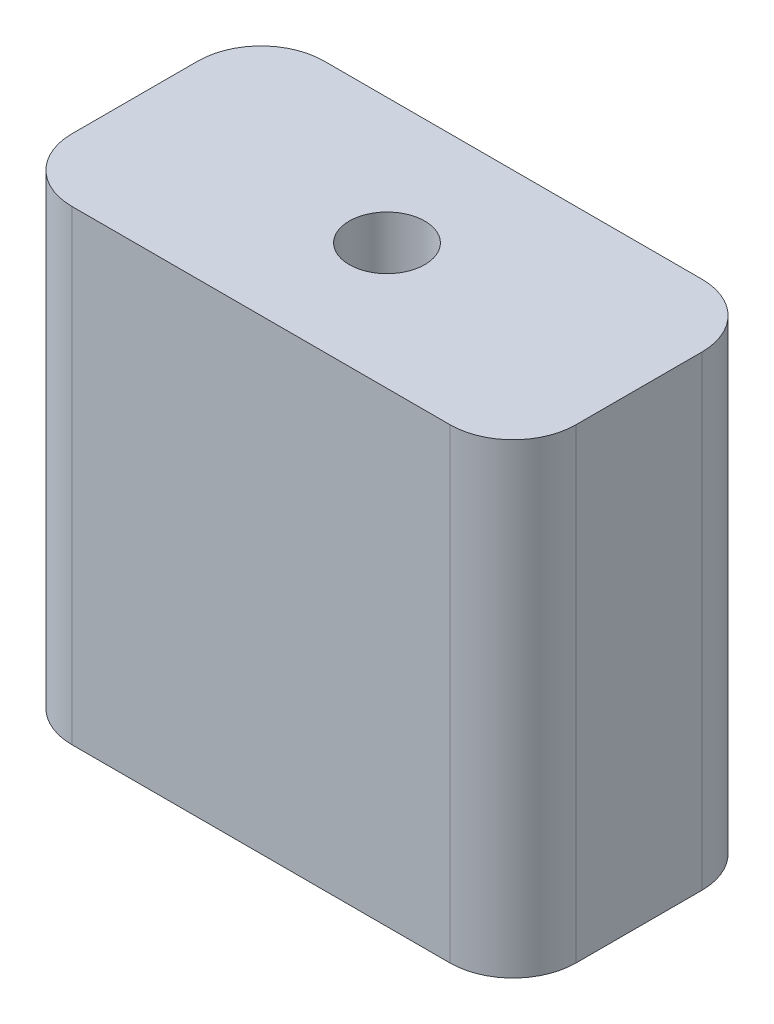
ISO-10303-21;
HEADER;
FILE_DESCRIPTION(('STEP AP214'),'2;1');
FILE_NAME('part.step','',(''),(''),'','','');
FILE_SCHEMA(('AUTOMOTIVE_DESIGN { 1 0 10303 214 1 1 1 1 }'));
ENDSEC;
DATA;
#1=APPLICATION_CONTEXT('core data for automotive mechanical design processes');
#2=APPLICATION_PROTOCOL_DEFINITION('international standard','automotive_design',2000,#1);
#3=PRODUCT_CONTEXT('',#1,'mechanical');
#4=PRODUCT('Part','Part','',(#3));
#5=PRODUCT_RELATED_PRODUCT_CATEGORY('part','',(#4));
#6=PRODUCT_DEFINITION_FORMATION('','',#4);
#7=PRODUCT_DEFINITION_CONTEXT('part definition',#1,'design');
#8=PRODUCT_DEFINITION('design','',#6,#7);
#9=PRODUCT_DEFINITION_SHAPE('','',#8);
#10=(LENGTH_UNIT() NAMED_UNIT(*) SI_UNIT(.MILLI.,.METRE.));
#11=(NAMED_UNIT(*) PLANE_ANGLE_UNIT() SI_UNIT($,.RADIAN.));
#12=(NAMED_UNIT(*) SI_UNIT($,.STERADIAN.) SOLID_ANGLE_UNIT());
#13=UNCERTAINTY_MEASURE_WITH_UNIT(LENGTH_MEASURE(1.E-05),#10,'distance_accuracy_value','');
#14=(GEOMETRIC_REPRESENTATION_CONTEXT(3) GLOBAL_UNCERTAINTY_ASSIGNED_CONTEXT((#13)) GLOBAL_UNIT_ASSIGNED_CONTEXT((#10,
#11,#12)) REPRESENTATION_CONTEXT('',''));
#15=CARTESIAN_POINT('',(0.,0.,0.));
#16=DIRECTION('',(0.,0.,1.));
#17=DIRECTION('',(1.,0.,0.));
#18=AXIS2_PLACEMENT_3D('',#15,#16,#17);
#19=CARTESIAN_POINT('',(20.,37.,10.));
#20=DIRECTION('',(-1.,0.,0.));
#21=DIRECTION('',(0.,0.,1.));
#22=AXIS2_PLACEMENT_3D('',#19,#20,#21);
#23=PLANE('',#22);
#24=DIRECTION('',(0.,0.,-1.));
#25=VECTOR('',#24,1.);
#26=CARTESIAN_POINT('',(20.,0.,10.));
#27=LINE('',#26,#25);
#28=CARTESIAN_POINT('',(20.,0.,5.));
#29=VERTEX_POINT('',#28);
#30=CARTESIAN_POINT('',(20.,0.,-5.));
#31=VERTEX_POINT('',#30);
#32=EDGE_CURVE('E141',#29,#31,#27,.T.);
#33=ORIENTED_EDGE('',*,*,#32,.T.);
#34=DIRECTION('',(0.,-1.,0.));
#35=VECTOR('',#34,1.);
#36=CARTESIAN_POINT('',(20.,37.,-5.));
#37=LINE('',#36,#35);
#38=CARTESIAN_POINT('',(20.,37.,-5.));
#39=VERTEX_POINT('',#38);
#40=EDGE_CURVE('E11',#31,#39,#37,.F.);
#41=ORIENTED_EDGE('',*,*,#40,.T.);
#42=DIRECTION('',(0.,0.,-1.));
#43=VECTOR('',#42,1.);
#44=CARTESIAN_POINT('',(20.,37.,10.));
#45=LINE('',#44,#43);
#46=CARTESIAN_POINT('',(20.,37.,5.));
#47=VERTEX_POINT('',#46);
#48=EDGE_CURVE('E139',#47,#39,#45,.T.);
#49=ORIENTED_EDGE('',*,*,#48,.F.);
#50=DIRECTION('',(0.,-1.,0.));
#51=VECTOR('',#50,1.);
#52=CARTESIAN_POINT('',(20.,37.,5.));
#53=LINE('',#52,#51);
#54=EDGE_CURVE('E48',#47,#29,#53,.T.);
#55=ORIENTED_EDGE('',*,*,#54,.T.);
#56=EDGE_LOOP('',(#33,#41,#49,#55));
#57=FACE_BOUND('',#56,.T.);
#58=ADVANCED_FACE('F39',(#57),#23,.F.);
#59=CARTESIAN_POINT('',(-20.,37.,-10.));
#60=DIRECTION('',(0.,0.,1.));
#61=DIRECTION('',(1.,0.,0.));
#62=AXIS2_PLACEMENT_3D('',#59,#60,#61);
#63=PLANE('',#62);
#64=DIRECTION('',(-1.,0.,0.));
#65=VECTOR('',#64,1.);
#66=CARTESIAN_POINT('',(-20.,0.,-10.));
#67=LINE('',#66,#65);
#68=CARTESIAN_POINT('',(15.,0.,-10.));
#69=VERTEX_POINT('',#68);
#70=CARTESIAN_POINT('',(-15.,0.,-10.));
#71=VERTEX_POINT('',#70);
#72=EDGE_CURVE('E135',#69,#71,#67,.T.);
#73=ORIENTED_EDGE('',*,*,#72,.T.);
#74=DIRECTION('',(0.,-1.,0.));
#75=VECTOR('',#74,1.);
#76=CARTESIAN_POINT('',(-15.,37.,-10.));
#77=LINE('',#76,#75);
#78=CARTESIAN_POINT('',(-15.,37.,-10.));
#79=VERTEX_POINT('',#78);
#80=EDGE_CURVE('E111',#71,#79,#77,.F.);
#81=ORIENTED_EDGE('',*,*,#80,.T.);
#82=DIRECTION('',(-1.,0.,0.));
#83=VECTOR('',#82,1.);
#84=CARTESIAN_POINT('',(-20.,37.,-10.));
#85=LINE('',#84,#83);
#86=CARTESIAN_POINT('',(15.,37.,-10.));
#87=VERTEX_POINT('',#86);
#88=EDGE_CURVE('E198',#87,#79,#85,.T.);
#89=ORIENTED_EDGE('',*,*,#88,.F.);
#90=DIRECTION('',(0.,-1.,0.));
#91=VECTOR('',#90,1.);
#92=CARTESIAN_POINT('',(15.,37.,-10.));
#93=LINE('',#92,#91);
#94=EDGE_CURVE('E117',#87,#69,#93,.T.);
#95=ORIENTED_EDGE('',*,*,#94,.T.);
#96=EDGE_LOOP('',(#73,#81,#89,#95));
#97=FACE_BOUND('',#96,.T.);
#98=ADVANCED_FACE('F218',(#97),#63,.F.);
#99=CARTESIAN_POINT('',(-20.,37.,10.));
#100=DIRECTION('',(1.,0.,0.));
#101=DIRECTION('',(0.,0.,-1.));
#102=AXIS2_PLACEMENT_3D('',#99,#100,#101);
#103=PLANE('',#102);
#104=DIRECTION('',(0.,0.,1.));
#105=VECTOR('',#104,1.);
#106=CARTESIAN_POINT('',(-20.,37.,10.));
#107=LINE('',#106,#105);
#108=CARTESIAN_POINT('',(-20.,37.,-5.));
#109=VERTEX_POINT('',#108);
#110=CARTESIAN_POINT('',(-20.,37.,5.));
#111=VERTEX_POINT('',#110);
#112=EDGE_CURVE('E126',#109,#111,#107,.T.);
#113=ORIENTED_EDGE('',*,*,#112,.F.);
#114=DIRECTION('',(0.,-1.,0.));
#115=VECTOR('',#114,1.);
#116=CARTESIAN_POINT('',(-20.,37.,-5.));
#117=LINE('',#116,#115);
#118=CARTESIAN_POINT('',(-20.,0.,-5.));
#119=VERTEX_POINT('',#118);
#120=EDGE_CURVE('E110',#109,#119,#117,.T.);
#121=ORIENTED_EDGE('',*,*,#120,.T.);
#122=DIRECTION('',(0.,0.,1.));
#123=VECTOR('',#122,1.);
#124=CARTESIAN_POINT('',(-20.,0.,10.));
#125=LINE('',#124,#123);
#126=CARTESIAN_POINT('',(-20.,0.,5.));
#127=VERTEX_POINT('',#126);
#128=EDGE_CURVE('E124',#119,#127,#125,.T.);
#129=ORIENTED_EDGE('',*,*,#128,.T.);
#130=DIRECTION('',(0.,-1.,0.));
#131=VECTOR('',#130,1.);
#132=CARTESIAN_POINT('',(-20.,37.,5.));
#133=LINE('',#132,#131);
#134=EDGE_CURVE('E129',#127,#111,#133,.F.);
#135=ORIENTED_EDGE('',*,*,#134,.T.);
#136=EDGE_LOOP('',(#113,#121,#129,#135));
#137=FACE_BOUND('',#136,.T.);
#138=ADVANCED_FACE('F123',(#137),#103,.F.);
#139=CARTESIAN_POINT('',(-20.,37.,10.));
#140=DIRECTION('',(0.,0.,-1.));
#141=DIRECTION('',(-1.,0.,0.));
#142=AXIS2_PLACEMENT_3D('',#139,#140,#141);
#143=PLANE('',#142);
#144=DIRECTION('',(1.,0.,0.));
#145=VECTOR('',#144,1.);
#146=CARTESIAN_POINT('',(-20.,37.,10.));
#147=LINE('',#146,#145);
#148=CARTESIAN_POINT('',(-15.,37.,10.));
#149=VERTEX_POINT('',#148);
#150=CARTESIAN_POINT('',(15.,37.,10.));
#151=VERTEX_POINT('',#150);
#152=EDGE_CURVE('E146',#149,#151,#147,.T.);
#153=ORIENTED_EDGE('',*,*,#152,.F.);
#154=DIRECTION('',(0.,-1.,0.));
#155=VECTOR('',#154,1.);
#156=CARTESIAN_POINT('',(-15.,37.,10.));
#157=LINE('',#156,#155);
#158=CARTESIAN_POINT('',(-15.,0.,10.));
#159=VERTEX_POINT('',#158);
#160=EDGE_CURVE('E173',#149,#159,#157,.T.);
#161=ORIENTED_EDGE('',*,*,#160,.T.);
#162=DIRECTION('',(1.,0.,0.));
#163=VECTOR('',#162,1.);
#164=CARTESIAN_POINT('',(-20.,0.,10.));
#165=LINE('',#164,#163);
#166=CARTESIAN_POINT('',(15.,0.,10.));
#167=VERTEX_POINT('',#166);
#168=EDGE_CURVE('E134',#159,#167,#165,.T.);
#169=ORIENTED_EDGE('',*,*,#168,.T.);
#170=DIRECTION('',(0.,-1.,0.));
#171=VECTOR('',#170,1.);
#172=CARTESIAN_POINT('',(15.,37.,10.));
#173=LINE('',#172,#171);
#174=EDGE_CURVE('E55',#167,#151,#173,.F.);
#175=ORIENTED_EDGE('',*,*,#174,.T.);
#176=EDGE_LOOP('',(#153,#161,#169,#175));
#177=FACE_BOUND('',#176,.T.);
#178=ADVANCED_FACE('F212',(#177),#143,.F.);
#179=CARTESIAN_POINT('',(0.,37.,0.));
#180=DIRECTION('',(0.,-1.,0.));
#181=DIRECTION('',(0.,0.,-1.));
#182=AXIS2_PLACEMENT_3D('',#179,#180,#181);
#183=PLANE('',#182);
#184=CARTESIAN_POINT('',(0.,37.,0.));
#185=DIRECTION('',(0.,1.,0.));
#186=DIRECTION('',(0.,0.,1.));
#187=AXIS2_PLACEMENT_3D('',#184,#185,#186);
#188=CIRCLE('',#187,3.);
#189=CARTESIAN_POINT('',(0.,37.,3.));
#190=VERTEX_POINT('',#189);
#191=EDGE_CURVE('E191',#190,#190,#188,.T.);
#192=ORIENTED_EDGE('',*,*,#191,.F.);
#193=EDGE_LOOP('',(#192));
#194=FACE_BOUND('',#193,.T.);
#195=ORIENTED_EDGE('',*,*,#88,.T.);
#196=CARTESIAN_POINT('',(-15.,37.,-5.));
#197=DIRECTION('',(0.,-1.,0.));
#198=DIRECTION('',(0.,0.,-1.));
#199=AXIS2_PLACEMENT_3D('',#196,#197,#198);
#200=CIRCLE('',#199,5.);
#201=EDGE_CURVE('E168',#79,#109,#200,.F.);
#202=ORIENTED_EDGE('',*,*,#201,.T.);
#203=ORIENTED_EDGE('',*,*,#112,.T.);
#204=CARTESIAN_POINT('',(-15.,37.,5.));
#205=DIRECTION('',(0.,-1.,0.));
#206=DIRECTION('',(0.,0.,-1.));
#207=AXIS2_PLACEMENT_3D('',#204,#205,#206);
#208=CIRCLE('',#207,5.);
#209=EDGE_CURVE('E62',#111,#149,#208,.F.);
#210=ORIENTED_EDGE('',*,*,#209,.T.);
#211=ORIENTED_EDGE('',*,*,#152,.T.);
#212=CARTESIAN_POINT('',(15.,37.,5.));
#213=DIRECTION('',(0.,-1.,0.));
#214=DIRECTION('',(0.,0.,-1.));
#215=AXIS2_PLACEMENT_3D('',#212,#213,#214);
#216=CIRCLE('',#215,5.);
#217=EDGE_CURVE('E160',#151,#47,#216,.F.);
#218=ORIENTED_EDGE('',*,*,#217,.T.);
#219=ORIENTED_EDGE('',*,*,#48,.T.);
#220=CARTESIAN_POINT('',(15.,37.,-5.));
#221=DIRECTION('',(0.,-1.,0.));
#222=DIRECTION('',(0.,0.,-1.));
#223=AXIS2_PLACEMENT_3D('',#220,#221,#222);
#224=CIRCLE('',#223,5.);
#225=EDGE_CURVE('E163',#39,#87,#224,.F.);
#226=ORIENTED_EDGE('',*,*,#225,.T.);
#227=EDGE_LOOP('',(#195,#202,#203,#210,#211,#218,#219,#226));
#228=FACE_BOUND('',#227,.T.);
#229=ADVANCED_FACE('F210',(#194,#228),#183,.F.);
#230=CARTESIAN_POINT('',(0.,0.,0.));
#231=DIRECTION('',(0.,-1.,0.));
#232=DIRECTION('',(0.,0.,-1.));
#233=AXIS2_PLACEMENT_3D('',#230,#231,#232);
#234=PLANE('',#233);
#235=ORIENTED_EDGE('',*,*,#128,.F.);
#236=CARTESIAN_POINT('',(-15.,0.,-5.));
#237=DIRECTION('',(0.,-1.,0.));
#238=DIRECTION('',(0.,0.,-1.));
#239=AXIS2_PLACEMENT_3D('',#236,#237,#238);
#240=CIRCLE('',#239,5.);
#241=EDGE_CURVE('E106',#119,#71,#240,.T.);
#242=ORIENTED_EDGE('',*,*,#241,.T.);
#243=ORIENTED_EDGE('',*,*,#72,.F.);
#244=CARTESIAN_POINT('',(15.,0.,-5.));
#245=DIRECTION('',(0.,-1.,0.));
#246=DIRECTION('',(0.,0.,-1.));
#247=AXIS2_PLACEMENT_3D('',#244,#245,#246);
#248=CIRCLE('',#247,5.);
#249=EDGE_CURVE('E150',#69,#31,#248,.T.);
#250=ORIENTED_EDGE('',*,*,#249,.T.);
#251=ORIENTED_EDGE('',*,*,#32,.F.);
#252=CARTESIAN_POINT('',(15.,0.,5.));
#253=DIRECTION('',(0.,-1.,0.));
#254=DIRECTION('',(0.,0.,-1.));
#255=AXIS2_PLACEMENT_3D('',#252,#253,#254);
#256=CIRCLE('',#255,5.);
#257=EDGE_CURVE('E128',#29,#167,#256,.T.);
#258=ORIENTED_EDGE('',*,*,#257,.T.);
#259=ORIENTED_EDGE('',*,*,#168,.F.);
#260=CARTESIAN_POINT('',(-15.,0.,5.));
#261=DIRECTION('',(0.,-1.,0.));
#262=DIRECTION('',(0.,0.,-1.));
#263=AXIS2_PLACEMENT_3D('',#260,#261,#262);
#264=CIRCLE('',#263,5.);
#265=EDGE_CURVE('E118',#159,#127,#264,.T.);
#266=ORIENTED_EDGE('',*,*,#265,.T.);
#267=EDGE_LOOP('',(#235,#242,#243,#250,#251,#258,#259,#266));
#268=FACE_BOUND('',#267,.T.);
#269=ADVANCED_FACE('F131',(#268),#234,.T.);
#270=CARTESIAN_POINT('',(-15.,37.,-5.));
#271=DIRECTION('',(0.,-1.,0.));
#272=DIRECTION('',(0.,0.,-1.));
#273=AXIS2_PLACEMENT_3D('',#270,#271,#272);
#274=CYLINDRICAL_SURFACE('',#273,5.);
#275=ORIENTED_EDGE('',*,*,#201,.F.);
#276=ORIENTED_EDGE('',*,*,#80,.F.);
#277=ORIENTED_EDGE('',*,*,#241,.F.);
#278=ORIENTED_EDGE('',*,*,#120,.F.);
#279=EDGE_LOOP('',(#275,#276,#277,#278));
#280=FACE_BOUND('',#279,.T.);
#281=ADVANCED_FACE('F109',(#280),#274,.T.);
#282=CARTESIAN_POINT('',(-15.,37.,5.));
#283=DIRECTION('',(0.,-1.,0.));
#284=DIRECTION('',(0.,0.,-1.));
#285=AXIS2_PLACEMENT_3D('',#282,#283,#284);
#286=CYLINDRICAL_SURFACE('',#285,5.);
#287=ORIENTED_EDGE('',*,*,#209,.F.);
#288=ORIENTED_EDGE('',*,*,#134,.F.);
#289=ORIENTED_EDGE('',*,*,#265,.F.);
#290=ORIENTED_EDGE('',*,*,#160,.F.);
#291=EDGE_LOOP('',(#287,#288,#289,#290));
#292=FACE_BOUND('',#291,.T.);
#293=ADVANCED_FACE('F229',(#292),#286,.T.);
#294=CARTESIAN_POINT('',(15.,37.,-5.));
#295=DIRECTION('',(0.,-1.,0.));
#296=DIRECTION('',(0.,0.,-1.));
#297=AXIS2_PLACEMENT_3D('',#294,#295,#296);
#298=CYLINDRICAL_SURFACE('',#297,5.);
#299=ORIENTED_EDGE('',*,*,#225,.F.);
#300=ORIENTED_EDGE('',*,*,#40,.F.);
#301=ORIENTED_EDGE('',*,*,#249,.F.);
#302=ORIENTED_EDGE('',*,*,#94,.F.);
#303=EDGE_LOOP('',(#299,#300,#301,#302));
#304=FACE_BOUND('',#303,.T.);
#305=ADVANCED_FACE('F220',(#304),#298,.T.);
#306=CARTESIAN_POINT('',(15.,37.,5.));
#307=DIRECTION('',(0.,-1.,0.));
#308=DIRECTION('',(0.,0.,-1.));
#309=AXIS2_PLACEMENT_3D('',#306,#307,#308);
#310=CYLINDRICAL_SURFACE('',#309,5.);
#311=ORIENTED_EDGE('',*,*,#217,.F.);
#312=ORIENTED_EDGE('',*,*,#174,.F.);
#313=ORIENTED_EDGE('',*,*,#257,.F.);
#314=ORIENTED_EDGE('',*,*,#54,.F.);
#315=EDGE_LOOP('',(#311,#312,#313,#314));
#316=FACE_BOUND('',#315,.T.);
#317=ADVANCED_FACE('F41',(#316),#310,.T.);
#318=CARTESIAN_POINT('',(0.,32.,0.));
#319=DIRECTION('',(0.,1.,0.));
#320=DIRECTION('',(0.,0.,1.));
#321=AXIS2_PLACEMENT_3D('',#318,#319,#320);
#322=CYLINDRICAL_SURFACE('',#321,3.);
#323=CARTESIAN_POINT('',(0.,32.,0.));
#324=DIRECTION('',(0.,1.,0.));
#325=DIRECTION('',(0.,0.,1.));
#326=AXIS2_PLACEMENT_3D('',#323,#324,#325);
#327=CIRCLE('',#326,3.);
#328=CARTESIAN_POINT('',(0.,32.,3.));
#329=VERTEX_POINT('',#328);
#330=EDGE_CURVE('E188',#329,#329,#327,.T.);
#331=ORIENTED_EDGE('',*,*,#330,.F.);
#332=EDGE_LOOP('',(#331));
#333=FACE_BOUND('',#332,.T.);
#334=ORIENTED_EDGE('',*,*,#191,.T.);
#335=EDGE_LOOP('',(#334));
#336=FACE_BOUND('',#335,.T.);
#337=ADVANCED_FACE('F208',(#333,#336),#322,.F.);
#338=CARTESIAN_POINT('',(0.,32.,0.));
#339=DIRECTION('',(0.,1.,0.));
#340=DIRECTION('',(0.,0.,1.));
#341=AXIS2_PLACEMENT_3D('',#338,#339,#340);
#342=PLANE('',#341);
#343=ORIENTED_EDGE('',*,*,#330,.T.);
#344=EDGE_LOOP('',(#343));
#345=FACE_BOUND('',#344,.T.);
#346=ADVANCED_FACE('F226',(#345),#342,.T.);
#347=CLOSED_SHELL('',(#58,#98,#138,#178,#229,#269,#281,#293,#305,#317,#337,#346));
#348=MANIFOLD_SOLID_BREP('B2',#347);
#349=ADVANCED_BREP_SHAPE_REPRESENTATION('',(#18,#348),#14);
#350=SHAPE_DEFINITION_REPRESENTATION(#9,#349);
ENDSEC;
END-ISO-10303-21;
